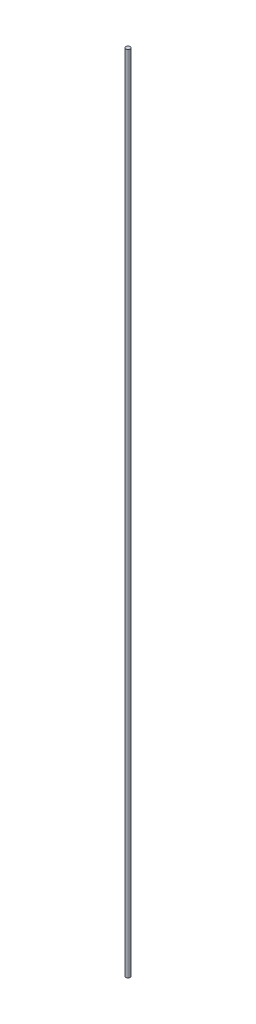
ISO-10303-21;
HEADER;
FILE_DESCRIPTION(('STEP AP214'),'2;1');
FILE_NAME('part.step','',(''),(''),'','','');
FILE_SCHEMA(('AUTOMOTIVE_DESIGN { 1 0 10303 214 1 1 1 1 }'));
ENDSEC;
DATA;
#1=APPLICATION_CONTEXT('core data for automotive mechanical design processes');
#2=APPLICATION_PROTOCOL_DEFINITION('international standard','automotive_design',2000,#1);
#3=PRODUCT_CONTEXT('',#1,'mechanical');
#4=PRODUCT('Part','Part','',(#3));
#5=PRODUCT_RELATED_PRODUCT_CATEGORY('part','',(#4));
#6=PRODUCT_DEFINITION_FORMATION('','',#4);
#7=PRODUCT_DEFINITION_CONTEXT('part definition',#1,'design');
#8=PRODUCT_DEFINITION('design','',#6,#7);
#9=PRODUCT_DEFINITION_SHAPE('','',#8);
#10=(LENGTH_UNIT() NAMED_UNIT(*) SI_UNIT(.MILLI.,.METRE.));
#11=(NAMED_UNIT(*) PLANE_ANGLE_UNIT() SI_UNIT($,.RADIAN.));
#12=(NAMED_UNIT(*) SI_UNIT($,.STERADIAN.) SOLID_ANGLE_UNIT());
#13=UNCERTAINTY_MEASURE_WITH_UNIT(LENGTH_MEASURE(1.E-05),#10,'distance_accuracy_value','');
#14=(GEOMETRIC_REPRESENTATION_CONTEXT(3) GLOBAL_UNCERTAINTY_ASSIGNED_CONTEXT((#13)) GLOBAL_UNIT_ASSIGNED_CONTEXT((#10,
#11,#12)) REPRESENTATION_CONTEXT('',''));
#15=CARTESIAN_POINT('',(0.,0.,0.));
#16=DIRECTION('',(0.,0.,1.));
#17=DIRECTION('',(1.,0.,0.));
#18=AXIS2_PLACEMENT_3D('',#15,#16,#17);
#19=CARTESIAN_POINT('',(0.,1124.,0.));
#20=DIRECTION('',(0.,-1.,0.));
#21=DIRECTION('',(0.,0.,-1.));
#22=AXIS2_PLACEMENT_3D('',#19,#20,#21);
#23=CYLINDRICAL_SURFACE('',#22,3.);
#24=CARTESIAN_POINT('',(0.,1124.,0.));
#25=DIRECTION('',(0.,1.,0.));
#26=DIRECTION('',(0.,0.,1.));
#27=AXIS2_PLACEMENT_3D('',#24,#25,#26);
#28=CIRCLE('',#27,3.);
#29=CARTESIAN_POINT('',(0.,1124.,3.));
#30=VERTEX_POINT('',#29);
#31=EDGE_CURVE('E10',#30,#30,#28,.T.);
#32=ORIENTED_EDGE('',*,*,#31,.F.);
#33=EDGE_LOOP('',(#32));
#34=FACE_BOUND('',#33,.T.);
#35=CARTESIAN_POINT('',(0.,0.,0.));
#36=DIRECTION('',(0.,1.,0.));
#37=DIRECTION('',(0.,0.,1.));
#38=AXIS2_PLACEMENT_3D('',#35,#36,#37);
#39=CIRCLE('',#38,3.);
#40=CARTESIAN_POINT('',(0.,0.,3.));
#41=VERTEX_POINT('',#40);
#42=EDGE_CURVE('E34',#41,#41,#39,.T.);
#43=ORIENTED_EDGE('',*,*,#42,.T.);
#44=EDGE_LOOP('',(#43));
#45=FACE_BOUND('',#44,.T.);
#46=ADVANCED_FACE('F31',(#34,#45),#23,.T.);
#47=CARTESIAN_POINT('',(0.,1124.,0.));
#48=DIRECTION('',(0.,1.,0.));
#49=DIRECTION('',(0.,0.,1.));
#50=AXIS2_PLACEMENT_3D('',#47,#48,#49);
#51=PLANE('',#50);
#52=ORIENTED_EDGE('',*,*,#31,.T.);
#53=EDGE_LOOP('',(#52));
#54=FACE_BOUND('',#53,.T.);
#55=ADVANCED_FACE('F46',(#54),#51,.T.);
#56=CARTESIAN_POINT('',(0.,0.,0.));
#57=DIRECTION('',(0.,1.,0.));
#58=DIRECTION('',(0.,0.,1.));
#59=AXIS2_PLACEMENT_3D('',#56,#57,#58);
#60=PLANE('',#59);
#61=ORIENTED_EDGE('',*,*,#42,.F.);
#62=EDGE_LOOP('',(#61));
#63=FACE_BOUND('',#62,.T.);
#64=ADVANCED_FACE('F44',(#63),#60,.F.);
#65=CLOSED_SHELL('',(#46,#55,#64));
#66=MANIFOLD_SOLID_BREP('B2',#65);
#67=ADVANCED_BREP_SHAPE_REPRESENTATION('',(#18,#66),#14);
#68=SHAPE_DEFINITION_REPRESENTATION(#9,#67);
ENDSEC;
END-ISO-10303-21;
